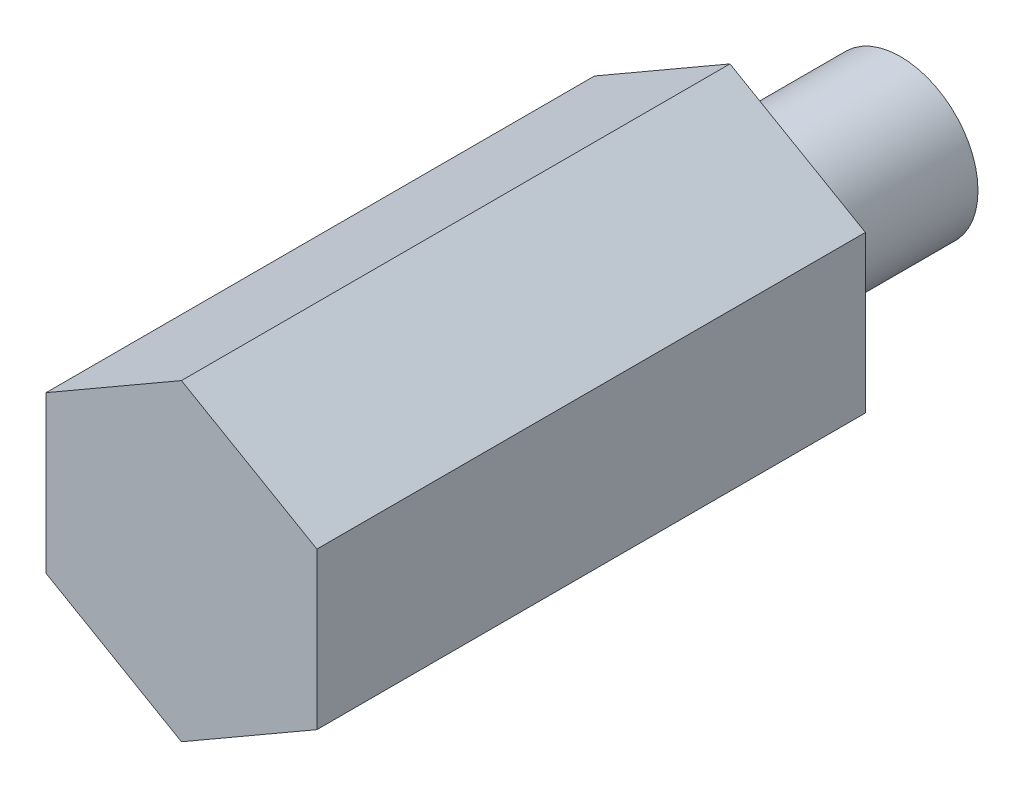
ISO-10303-21;
HEADER;
FILE_DESCRIPTION(('STEP AP214'),'2;1');
FILE_NAME('part.step','',(''),(''),'','','');
FILE_SCHEMA(('AUTOMOTIVE_DESIGN { 1 0 10303 214 1 1 1 1 }'));
ENDSEC;
DATA;
#1=APPLICATION_CONTEXT('core data for automotive mechanical design processes');
#2=APPLICATION_PROTOCOL_DEFINITION('international standard','automotive_design',2000,#1);
#3=PRODUCT_CONTEXT('',#1,'mechanical');
#4=PRODUCT('Part','Part','',(#3));
#5=PRODUCT_RELATED_PRODUCT_CATEGORY('part','',(#4));
#6=PRODUCT_DEFINITION_FORMATION('','',#4);
#7=PRODUCT_DEFINITION_CONTEXT('part definition',#1,'design');
#8=PRODUCT_DEFINITION('design','',#6,#7);
#9=PRODUCT_DEFINITION_SHAPE('','',#8);
#10=(LENGTH_UNIT() NAMED_UNIT(*) SI_UNIT(.MILLI.,.METRE.));
#11=(NAMED_UNIT(*) PLANE_ANGLE_UNIT() SI_UNIT($,.RADIAN.));
#12=(NAMED_UNIT(*) SI_UNIT($,.STERADIAN.) SOLID_ANGLE_UNIT());
#13=UNCERTAINTY_MEASURE_WITH_UNIT(LENGTH_MEASURE(1.E-05),#10,'distance_accuracy_value','');
#14=(GEOMETRIC_REPRESENTATION_CONTEXT(3) GLOBAL_UNCERTAINTY_ASSIGNED_CONTEXT((#13)) GLOBAL_UNIT_ASSIGNED_CONTEXT((#10,
#11,#12)) REPRESENTATION_CONTEXT('',''));
#15=CARTESIAN_POINT('',(0.,0.,0.));
#16=DIRECTION('',(0.,0.,1.));
#17=DIRECTION('',(1.,0.,0.));
#18=AXIS2_PLACEMENT_3D('',#15,#16,#17);
#19=CARTESIAN_POINT('',(-5.55625,3.20790243318486,11.25));
#20=DIRECTION('',(1.,0.,0.));
#21=DIRECTION('',(0.,1.,0.));
#22=AXIS2_PLACEMENT_3D('',#19,#20,#21);
#23=PLANE('',#22);
#24=DIRECTION('',(0.,0.,-1.));
#25=VECTOR('',#24,1.);
#26=CARTESIAN_POINT('',(-5.55625,3.20790243318486,11.25));
#27=LINE('',#26,#25);
#28=CARTESIAN_POINT('',(-5.55625,3.20790243318486,11.25));
#29=VERTEX_POINT('',#28);
#30=CARTESIAN_POINT('',(-5.55625,3.20790243318486,-11.25));
#31=VERTEX_POINT('',#30);
#32=EDGE_CURVE('E113',#29,#31,#27,.T.);
#33=ORIENTED_EDGE('',*,*,#32,.T.);
#34=DIRECTION('',(0.,-1.,0.));
#35=VECTOR('',#34,1.);
#36=CARTESIAN_POINT('',(-5.55625,3.20790243318486,-11.25));
#37=LINE('',#36,#35);
#38=CARTESIAN_POINT('',(-5.55625,-3.20790243318486,-11.25));
#39=VERTEX_POINT('',#38);
#40=EDGE_CURVE('E107',#31,#39,#37,.T.);
#41=ORIENTED_EDGE('',*,*,#40,.T.);
#42=DIRECTION('',(0.,0.,-1.));
#43=VECTOR('',#42,1.);
#44=CARTESIAN_POINT('',(-5.55625,-3.20790243318486,11.25));
#45=LINE('',#44,#43);
#46=CARTESIAN_POINT('',(-5.55625,-3.20790243318486,11.25));
#47=VERTEX_POINT('',#46);
#48=EDGE_CURVE('E11',#47,#39,#45,.T.);
#49=ORIENTED_EDGE('',*,*,#48,.F.);
#50=DIRECTION('',(0.,-1.,0.));
#51=VECTOR('',#50,1.);
#52=CARTESIAN_POINT('',(-5.55625,3.20790243318486,11.25));
#53=LINE('',#52,#51);
#54=EDGE_CURVE('E130',#29,#47,#53,.T.);
#55=ORIENTED_EDGE('',*,*,#54,.F.);
#56=EDGE_LOOP('',(#33,#41,#49,#55));
#57=FACE_BOUND('',#56,.T.);
#58=ADVANCED_FACE('F43',(#57),#23,.F.);
#59=CARTESIAN_POINT('',(-5.55625,-3.20790243318486,11.25));
#60=DIRECTION('',(0.5,0.866025403784439,0.));
#61=DIRECTION('',(-0.866025403784439,0.5,0.));
#62=AXIS2_PLACEMENT_3D('',#59,#60,#61);
#63=PLANE('',#62);
#64=ORIENTED_EDGE('',*,*,#48,.T.);
#65=DIRECTION('',(0.866025403784439,-0.5,0.));
#66=VECTOR('',#65,1.);
#67=CARTESIAN_POINT('',(-5.55625,-3.20790243318486,-11.25));
#68=LINE('',#67,#66);
#69=CARTESIAN_POINT('',(0.,-6.41580486636971,-11.25));
#70=VERTEX_POINT('',#69);
#71=EDGE_CURVE('E97',#39,#70,#68,.T.);
#72=ORIENTED_EDGE('',*,*,#71,.T.);
#73=DIRECTION('',(0.,0.,-1.));
#74=VECTOR('',#73,1.);
#75=CARTESIAN_POINT('',(0.,-6.41580486636971,11.25));
#76=LINE('',#75,#74);
#77=CARTESIAN_POINT('',(0.,-6.41580486636971,11.25));
#78=VERTEX_POINT('',#77);
#79=EDGE_CURVE('E50',#78,#70,#76,.T.);
#80=ORIENTED_EDGE('',*,*,#79,.F.);
#81=DIRECTION('',(0.866025403784439,-0.5,0.));
#82=VECTOR('',#81,1.);
#83=CARTESIAN_POINT('',(-5.55625,-3.20790243318486,11.25));
#84=LINE('',#83,#82);
#85=EDGE_CURVE('E98',#47,#78,#84,.T.);
#86=ORIENTED_EDGE('',*,*,#85,.F.);
#87=EDGE_LOOP('',(#64,#72,#80,#86));
#88=FACE_BOUND('',#87,.T.);
#89=ADVANCED_FACE('F95',(#88),#63,.F.);
#90=CARTESIAN_POINT('',(0.,-6.41580486636971,11.25));
#91=DIRECTION('',(-0.5,0.866025403784439,0.));
#92=DIRECTION('',(-0.866025403784439,-0.5,0.));
#93=AXIS2_PLACEMENT_3D('',#90,#91,#92);
#94=PLANE('',#93);
#95=ORIENTED_EDGE('',*,*,#79,.T.);
#96=DIRECTION('',(0.866025403784439,0.5,0.));
#97=VECTOR('',#96,1.);
#98=CARTESIAN_POINT('',(0.,-6.41580486636971,-11.25));
#99=LINE('',#98,#97);
#100=CARTESIAN_POINT('',(5.55625,-3.20790243318486,-11.25));
#101=VERTEX_POINT('',#100);
#102=EDGE_CURVE('E111',#70,#101,#99,.T.);
#103=ORIENTED_EDGE('',*,*,#102,.T.);
#104=DIRECTION('',(0.,0.,-1.));
#105=VECTOR('',#104,1.);
#106=CARTESIAN_POINT('',(5.55625,-3.20790243318486,11.25));
#107=LINE('',#106,#105);
#108=CARTESIAN_POINT('',(5.55625,-3.20790243318486,11.25));
#109=VERTEX_POINT('',#108);
#110=EDGE_CURVE('E144',#109,#101,#107,.T.);
#111=ORIENTED_EDGE('',*,*,#110,.F.);
#112=DIRECTION('',(0.866025403784439,0.5,0.));
#113=VECTOR('',#112,1.);
#114=CARTESIAN_POINT('',(0.,-6.41580486636971,11.25));
#115=LINE('',#114,#113);
#116=EDGE_CURVE('E133',#78,#109,#115,.T.);
#117=ORIENTED_EDGE('',*,*,#116,.F.);
#118=EDGE_LOOP('',(#95,#103,#111,#117));
#119=FACE_BOUND('',#118,.T.);
#120=ADVANCED_FACE('F147',(#119),#94,.F.);
#121=CARTESIAN_POINT('',(5.55625,-3.20790243318486,11.25));
#122=DIRECTION('',(-1.,0.,0.));
#123=DIRECTION('',(0.,0.,1.));
#124=AXIS2_PLACEMENT_3D('',#121,#122,#123);
#125=PLANE('',#124);
#126=ORIENTED_EDGE('',*,*,#110,.T.);
#127=DIRECTION('',(0.,1.,0.));
#128=VECTOR('',#127,1.);
#129=CARTESIAN_POINT('',(5.55625,-3.20790243318486,-11.25));
#130=LINE('',#129,#128);
#131=CARTESIAN_POINT('',(5.55625,3.20790243318486,-11.25));
#132=VERTEX_POINT('',#131);
#133=EDGE_CURVE('E122',#101,#132,#130,.T.);
#134=ORIENTED_EDGE('',*,*,#133,.T.);
#135=DIRECTION('',(0.,0.,-1.));
#136=VECTOR('',#135,1.);
#137=CARTESIAN_POINT('',(5.55625,3.20790243318486,11.25));
#138=LINE('',#137,#136);
#139=CARTESIAN_POINT('',(5.55625,3.20790243318486,11.25));
#140=VERTEX_POINT('',#139);
#141=EDGE_CURVE('E142',#140,#132,#138,.T.);
#142=ORIENTED_EDGE('',*,*,#141,.F.);
#143=DIRECTION('',(0.,1.,0.));
#144=VECTOR('',#143,1.);
#145=CARTESIAN_POINT('',(5.55625,-3.20790243318486,11.25));
#146=LINE('',#145,#144);
#147=EDGE_CURVE('E135',#109,#140,#146,.T.);
#148=ORIENTED_EDGE('',*,*,#147,.F.);
#149=EDGE_LOOP('',(#126,#134,#142,#148));
#150=FACE_BOUND('',#149,.T.);
#151=ADVANCED_FACE('F153',(#150),#125,.F.);
#152=CARTESIAN_POINT('',(5.55625,3.20790243318486,11.25));
#153=DIRECTION('',(-0.5,-0.866025403784439,0.));
#154=DIRECTION('',(0.866025403784439,-0.5,0.));
#155=AXIS2_PLACEMENT_3D('',#152,#153,#154);
#156=PLANE('',#155);
#157=ORIENTED_EDGE('',*,*,#141,.T.);
#158=DIRECTION('',(-0.866025403784439,0.5,0.));
#159=VECTOR('',#158,1.);
#160=CARTESIAN_POINT('',(5.55625,3.20790243318486,-11.25));
#161=LINE('',#160,#159);
#162=CARTESIAN_POINT('',(0.,6.41580486636972,-11.25));
#163=VERTEX_POINT('',#162);
#164=EDGE_CURVE('E125',#132,#163,#161,.T.);
#165=ORIENTED_EDGE('',*,*,#164,.T.);
#166=DIRECTION('',(0.,0.,-1.));
#167=VECTOR('',#166,1.);
#168=CARTESIAN_POINT('',(0.,6.41580486636972,11.25));
#169=LINE('',#168,#167);
#170=CARTESIAN_POINT('',(0.,6.41580486636972,11.25));
#171=VERTEX_POINT('',#170);
#172=EDGE_CURVE('E140',#171,#163,#169,.T.);
#173=ORIENTED_EDGE('',*,*,#172,.F.);
#174=DIRECTION('',(-0.866025403784439,0.5,0.));
#175=VECTOR('',#174,1.);
#176=CARTESIAN_POINT('',(5.55625,3.20790243318486,11.25));
#177=LINE('',#176,#175);
#178=EDGE_CURVE('E62',#140,#171,#177,.T.);
#179=ORIENTED_EDGE('',*,*,#178,.F.);
#180=EDGE_LOOP('',(#157,#165,#173,#179));
#181=FACE_BOUND('',#180,.T.);
#182=ADVANCED_FACE('F156',(#181),#156,.F.);
#183=CARTESIAN_POINT('',(0.,6.41580486636972,11.25));
#184=DIRECTION('',(0.5,-0.866025403784439,0.));
#185=DIRECTION('',(0.866025403784439,0.5,0.));
#186=AXIS2_PLACEMENT_3D('',#183,#184,#185);
#187=PLANE('',#186);
#188=ORIENTED_EDGE('',*,*,#172,.T.);
#189=DIRECTION('',(-0.866025403784439,-0.5,0.));
#190=VECTOR('',#189,1.);
#191=CARTESIAN_POINT('',(0.,6.41580486636972,-11.25));
#192=LINE('',#191,#190);
#193=EDGE_CURVE('E128',#163,#31,#192,.T.);
#194=ORIENTED_EDGE('',*,*,#193,.T.);
#195=ORIENTED_EDGE('',*,*,#32,.F.);
#196=DIRECTION('',(-0.866025403784439,-0.5,0.));
#197=VECTOR('',#196,1.);
#198=CARTESIAN_POINT('',(0.,6.41580486636972,11.25));
#199=LINE('',#198,#197);
#200=EDGE_CURVE('E57',#171,#29,#199,.T.);
#201=ORIENTED_EDGE('',*,*,#200,.F.);
#202=EDGE_LOOP('',(#188,#194,#195,#201));
#203=FACE_BOUND('',#202,.T.);
#204=ADVANCED_FACE('F158',(#203),#187,.F.);
#205=CARTESIAN_POINT('',(0.,0.,11.25));
#206=DIRECTION('',(0.,0.,1.));
#207=DIRECTION('',(1.,0.,0.));
#208=AXIS2_PLACEMENT_3D('',#205,#206,#207);
#209=PLANE('',#208);
#210=ORIENTED_EDGE('',*,*,#54,.T.);
#211=ORIENTED_EDGE('',*,*,#85,.T.);
#212=ORIENTED_EDGE('',*,*,#116,.T.);
#213=ORIENTED_EDGE('',*,*,#147,.T.);
#214=ORIENTED_EDGE('',*,*,#178,.T.);
#215=ORIENTED_EDGE('',*,*,#200,.T.);
#216=EDGE_LOOP('',(#210,#211,#212,#213,#214,#215));
#217=FACE_BOUND('',#216,.T.);
#218=ADVANCED_FACE('F150',(#217),#209,.T.);
#219=CARTESIAN_POINT('',(0.,0.,-11.25));
#220=DIRECTION('',(0.,0.,1.));
#221=DIRECTION('',(1.,0.,0.));
#222=AXIS2_PLACEMENT_3D('',#219,#220,#221);
#223=PLANE('',#222);
#224=CARTESIAN_POINT('',(0.,0.,-11.25));
#225=DIRECTION('',(0.,0.,1.));
#226=DIRECTION('',(1.,0.,0.));
#227=AXIS2_PLACEMENT_3D('',#224,#225,#226);
#228=CIRCLE('',#227,3.175);
#229=CARTESIAN_POINT('',(3.175,0.,-11.25));
#230=VERTEX_POINT('',#229);
#231=EDGE_CURVE('E117',#230,#230,#228,.T.);
#232=ORIENTED_EDGE('',*,*,#231,.T.);
#233=EDGE_LOOP('',(#232));
#234=FACE_BOUND('',#233,.T.);
#235=ORIENTED_EDGE('',*,*,#40,.F.);
#236=ORIENTED_EDGE('',*,*,#193,.F.);
#237=ORIENTED_EDGE('',*,*,#164,.F.);
#238=ORIENTED_EDGE('',*,*,#133,.F.);
#239=ORIENTED_EDGE('',*,*,#102,.F.);
#240=ORIENTED_EDGE('',*,*,#71,.F.);
#241=EDGE_LOOP('',(#235,#236,#237,#238,#239,#240));
#242=FACE_BOUND('',#241,.T.);
#243=ADVANCED_FACE('F105',(#234,#242),#223,.F.);
#244=CARTESIAN_POINT('',(0.,0.,-18.2500114));
#245=DIRECTION('',(0.,0.,1.));
#246=DIRECTION('',(1.,0.,0.));
#247=AXIS2_PLACEMENT_3D('',#244,#245,#246);
#248=CYLINDRICAL_SURFACE('',#247,3.175);
#249=CARTESIAN_POINT('',(0.,0.,-18.2500114));
#250=DIRECTION('',(0.,0.,1.));
#251=DIRECTION('',(1.,0.,0.));
#252=AXIS2_PLACEMENT_3D('',#249,#250,#251);
#253=CIRCLE('',#252,3.175);
#254=CARTESIAN_POINT('',(3.175,0.,-18.2500114));
#255=VERTEX_POINT('',#254);
#256=EDGE_CURVE('E114',#255,#255,#253,.T.);
#257=ORIENTED_EDGE('',*,*,#256,.T.);
#258=EDGE_LOOP('',(#257));
#259=FACE_BOUND('',#258,.T.);
#260=ORIENTED_EDGE('',*,*,#231,.F.);
#261=EDGE_LOOP('',(#260));
#262=FACE_BOUND('',#261,.T.);
#263=ADVANCED_FACE('F206',(#259,#262),#248,.T.);
#264=CARTESIAN_POINT('',(0.,0.,-18.2500114));
#265=DIRECTION('',(0.,0.,1.));
#266=DIRECTION('',(1.,0.,0.));
#267=AXIS2_PLACEMENT_3D('',#264,#265,#266);
#268=PLANE('',#267);
#269=ORIENTED_EDGE('',*,*,#256,.F.);
#270=EDGE_LOOP('',(#269));
#271=FACE_BOUND('',#270,.T.);
#272=ADVANCED_FACE('F216',(#271),#268,.F.);
#273=CLOSED_SHELL('',(#58,#89,#120,#151,#182,#204,#218,#243,#263,#272));
#274=MANIFOLD_SOLID_BREP('B2',#273);
#275=ADVANCED_BREP_SHAPE_REPRESENTATION('',(#18,#274),#14);
#276=SHAPE_DEFINITION_REPRESENTATION(#9,#275);
ENDSEC;
END-ISO-10303-21;
